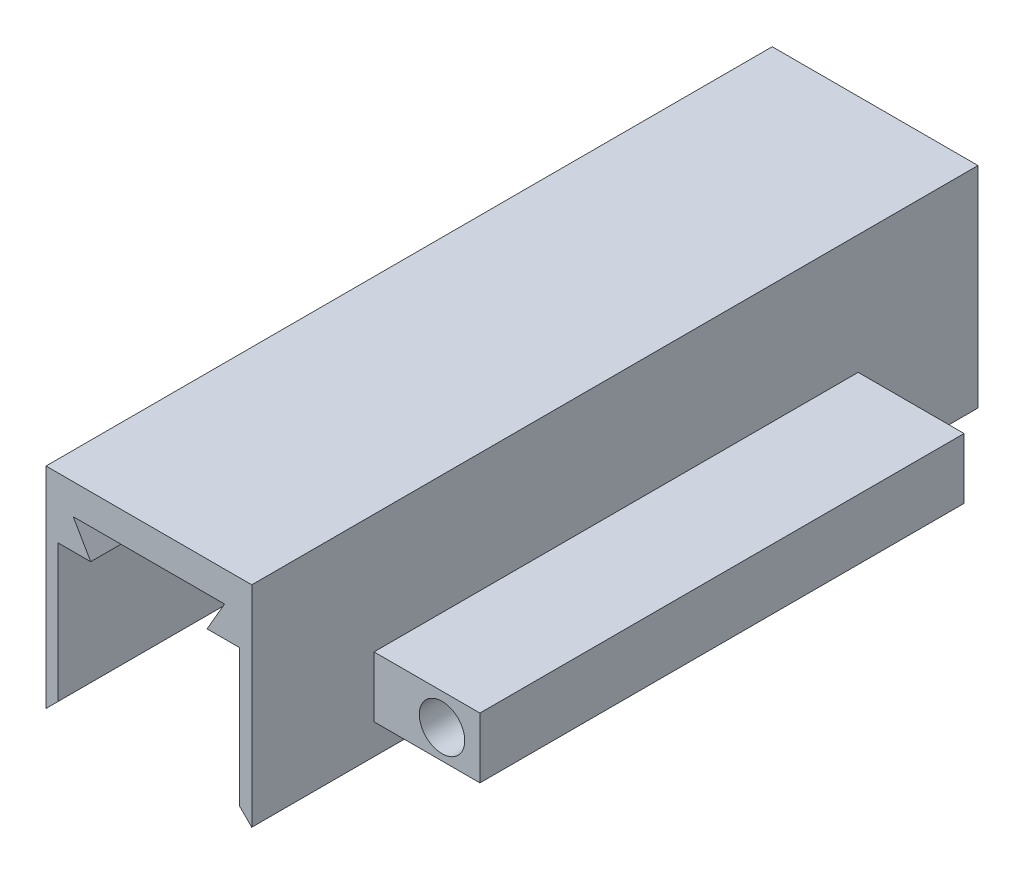
ISO-10303-21;
HEADER;
FILE_DESCRIPTION(('STEP AP214'),'2;1');
FILE_NAME('part.step','',(''),(''),'','','');
FILE_SCHEMA(('AUTOMOTIVE_DESIGN { 1 0 10303 214 1 1 1 1 }'));
ENDSEC;
DATA;
#1=APPLICATION_CONTEXT('core data for automotive mechanical design processes');
#2=APPLICATION_PROTOCOL_DEFINITION('international standard','automotive_design',2000,#1);
#3=PRODUCT_CONTEXT('',#1,'mechanical');
#4=PRODUCT('Part','Part','',(#3));
#5=PRODUCT_RELATED_PRODUCT_CATEGORY('part','',(#4));
#6=PRODUCT_DEFINITION_FORMATION('','',#4);
#7=PRODUCT_DEFINITION_CONTEXT('part definition',#1,'design');
#8=PRODUCT_DEFINITION('design','',#6,#7);
#9=PRODUCT_DEFINITION_SHAPE('','',#8);
#10=(LENGTH_UNIT() NAMED_UNIT(*) SI_UNIT(.MILLI.,.METRE.));
#11=(NAMED_UNIT(*) PLANE_ANGLE_UNIT() SI_UNIT($,.RADIAN.));
#12=(NAMED_UNIT(*) SI_UNIT($,.STERADIAN.) SOLID_ANGLE_UNIT());
#13=UNCERTAINTY_MEASURE_WITH_UNIT(LENGTH_MEASURE(1.E-05),#10,'distance_accuracy_value','');
#14=(GEOMETRIC_REPRESENTATION_CONTEXT(3) GLOBAL_UNCERTAINTY_ASSIGNED_CONTEXT((#13)) GLOBAL_UNIT_ASSIGNED_CONTEXT((#10,
#11,#12)) REPRESENTATION_CONTEXT('',''));
#15=CARTESIAN_POINT('',(0.,0.,0.));
#16=DIRECTION('',(0.,0.,1.));
#17=DIRECTION('',(1.,0.,0.));
#18=AXIS2_PLACEMENT_3D('',#15,#16,#17);
#19=CARTESIAN_POINT('',(2.824,-1.49,-4.));
#20=DIRECTION('',(0.,0.,1.));
#21=DIRECTION('',(1.,0.,0.));
#22=AXIS2_PLACEMENT_3D('',#19,#20,#21);
#23=CYLINDRICAL_SURFACE('',#22,0.375000000000001);
#24=CARTESIAN_POINT('',(2.824,-1.49,4.));
#25=DIRECTION('',(0.,0.,1.));
#26=DIRECTION('',(1.,0.,0.));
#27=AXIS2_PLACEMENT_3D('',#24,#25,#26);
#28=CIRCLE('',#27,0.375000000000001);
#29=CARTESIAN_POINT('',(3.199,-1.49,4.));
#30=VERTEX_POINT('',#29);
#31=EDGE_CURVE('E166',#30,#30,#28,.T.);
#32=ORIENTED_EDGE('',*,*,#31,.T.);
#33=EDGE_LOOP('',(#32));
#34=FACE_BOUND('',#33,.T.);
#35=CARTESIAN_POINT('',(2.824,-1.49,-3.5));
#36=DIRECTION('',(0.,0.,-1.));
#37=DIRECTION('',(-1.,0.,0.));
#38=AXIS2_PLACEMENT_3D('',#35,#36,#37);
#39=CIRCLE('',#38,0.375000000000001);
#40=CARTESIAN_POINT('',(2.449,-1.49,-3.5));
#41=VERTEX_POINT('',#40);
#42=EDGE_CURVE('E11',#41,#41,#39,.F.);
#43=ORIENTED_EDGE('',*,*,#42,.F.);
#44=EDGE_LOOP('',(#43));
#45=FACE_BOUND('',#44,.T.);
#46=ADVANCED_FACE('F35',(#34,#45),#23,.F.);
#47=CARTESIAN_POINT('',(1.7,0.,6.02));
#48=DIRECTION('',(1.,0.,0.));
#49=DIRECTION('',(0.,1.,0.));
#50=AXIS2_PLACEMENT_3D('',#47,#48,#49);
#51=PLANE('',#50);
#52=DIRECTION('',(0.,0.,-1.));
#53=VECTOR('',#52,1.);
#54=CARTESIAN_POINT('',(1.7,-2.47,6.02));
#55=LINE('',#54,#53);
#56=CARTESIAN_POINT('',(1.7,-2.47,6.02));
#57=VERTEX_POINT('',#56);
#58=CARTESIAN_POINT('',(1.7,-2.47,-5.98));
#59=VERTEX_POINT('',#58);
#60=EDGE_CURVE('E267',#57,#59,#55,.T.);
#61=ORIENTED_EDGE('',*,*,#60,.T.);
#62=DIRECTION('',(0.,-1.,0.));
#63=VECTOR('',#62,1.);
#64=CARTESIAN_POINT('',(1.7,0.,-5.98));
#65=LINE('',#64,#63);
#66=CARTESIAN_POINT('',(1.7,1.,-5.98));
#67=VERTEX_POINT('',#66);
#68=EDGE_CURVE('E196',#67,#59,#65,.T.);
#69=ORIENTED_EDGE('',*,*,#68,.F.);
#70=DIRECTION('',(0.,0.,-1.));
#71=VECTOR('',#70,1.);
#72=CARTESIAN_POINT('',(1.7,1.,6.02));
#73=LINE('',#72,#71);
#74=CARTESIAN_POINT('',(1.7,1.,6.02));
#75=VERTEX_POINT('',#74);
#76=EDGE_CURVE('E265',#75,#67,#73,.T.);
#77=ORIENTED_EDGE('',*,*,#76,.F.);
#78=DIRECTION('',(0.,-1.,0.));
#79=VECTOR('',#78,1.);
#80=CARTESIAN_POINT('',(1.7,0.,6.02));
#81=LINE('',#80,#79);
#82=EDGE_CURVE('E228',#75,#57,#81,.T.);
#83=ORIENTED_EDGE('',*,*,#82,.T.);
#84=EDGE_LOOP('',(#61,#69,#77,#83));
#85=FACE_BOUND('',#84,.T.);
#86=DIRECTION('',(0.,0.,1.));
#87=VECTOR('',#86,1.);
#88=CARTESIAN_POINT('',(1.7,-0.969999999999999,-4.));
#89=LINE('',#88,#87);
#90=CARTESIAN_POINT('',(1.7,-0.969999999999999,-4.));
#91=VERTEX_POINT('',#90);
#92=CARTESIAN_POINT('',(1.7,-0.969999999999999,4.));
#93=VERTEX_POINT('',#92);
#94=EDGE_CURVE('E55',#91,#93,#89,.T.);
#95=ORIENTED_EDGE('',*,*,#94,.F.);
#96=DIRECTION('',(0.,-1.,0.));
#97=VECTOR('',#96,1.);
#98=CARTESIAN_POINT('',(1.7,0.,-4.));
#99=LINE('',#98,#97);
#100=CARTESIAN_POINT('',(1.7,-1.97,-4.));
#101=VERTEX_POINT('',#100);
#102=EDGE_CURVE('E50',#91,#101,#99,.T.);
#103=ORIENTED_EDGE('',*,*,#102,.T.);
#104=DIRECTION('',(0.,0.,1.));
#105=VECTOR('',#104,1.);
#106=CARTESIAN_POINT('',(1.7,-1.97,-4.));
#107=LINE('',#106,#105);
#108=CARTESIAN_POINT('',(1.7,-1.97,4.));
#109=VERTEX_POINT('',#108);
#110=EDGE_CURVE('E184',#101,#109,#107,.T.);
#111=ORIENTED_EDGE('',*,*,#110,.T.);
#112=DIRECTION('',(0.,-1.,0.));
#113=VECTOR('',#112,1.);
#114=CARTESIAN_POINT('',(1.7,0.,4.));
#115=LINE('',#114,#113);
#116=EDGE_CURVE('E169',#93,#109,#115,.T.);
#117=ORIENTED_EDGE('',*,*,#116,.F.);
#118=EDGE_LOOP('',(#95,#103,#111,#117));
#119=FACE_BOUND('',#118,.T.);
#120=ADVANCED_FACE('F319',(#85,#119),#51,.T.);
#121=CARTESIAN_POINT('',(0.,0.,6.02));
#122=DIRECTION('',(0.,1.,0.));
#123=DIRECTION('',(0.,0.,1.));
#124=AXIS2_PLACEMENT_3D('',#121,#122,#123);
#125=PLANE('',#124);
#126=DIRECTION('',(0.,0.,-1.));
#127=VECTOR('',#126,1.);
#128=CARTESIAN_POINT('',(0.961324865405187,0.,6.02));
#129=LINE('',#128,#127);
#130=CARTESIAN_POINT('',(0.961324865405187,0.,6.02));
#131=VERTEX_POINT('',#130);
#132=CARTESIAN_POINT('',(0.961324865405187,0.,-5.98));
#133=VERTEX_POINT('',#132);
#134=EDGE_CURVE('E249',#131,#133,#129,.T.);
#135=ORIENTED_EDGE('',*,*,#134,.T.);
#136=DIRECTION('',(1.,0.,0.));
#137=VECTOR('',#136,1.);
#138=CARTESIAN_POINT('',(0.,0.,-5.98));
#139=LINE('',#138,#137);
#140=CARTESIAN_POINT('',(1.5,0.,-5.98));
#141=VERTEX_POINT('',#140);
#142=EDGE_CURVE('E183',#133,#141,#139,.T.);
#143=ORIENTED_EDGE('',*,*,#142,.T.);
#144=DIRECTION('',(0.,0.,-1.));
#145=VECTOR('',#144,1.);
#146=CARTESIAN_POINT('',(1.5,0.,6.02));
#147=LINE('',#146,#145);
#148=CARTESIAN_POINT('',(1.5,0.,6.02));
#149=VERTEX_POINT('',#148);
#150=EDGE_CURVE('E43',#149,#141,#147,.T.);
#151=ORIENTED_EDGE('',*,*,#150,.F.);
#152=DIRECTION('',(1.,0.,0.));
#153=VECTOR('',#152,1.);
#154=CARTESIAN_POINT('',(0.,0.,6.02));
#155=LINE('',#154,#153);
#156=EDGE_CURVE('E220',#131,#149,#155,.T.);
#157=ORIENTED_EDGE('',*,*,#156,.F.);
#158=EDGE_LOOP('',(#135,#143,#151,#157));
#159=FACE_BOUND('',#158,.T.);
#160=ADVANCED_FACE('F280',(#159),#125,.F.);
#161=CARTESIAN_POINT('',(1.5,0.,6.02));
#162=DIRECTION('',(1.,0.,0.));
#163=DIRECTION('',(0.,1.,0.));
#164=AXIS2_PLACEMENT_3D('',#161,#162,#163);
#165=PLANE('',#164);
#166=ORIENTED_EDGE('',*,*,#150,.T.);
#167=DIRECTION('',(0.,-1.,0.));
#168=VECTOR('',#167,1.);
#169=CARTESIAN_POINT('',(1.5,0.,-5.98));
#170=LINE('',#169,#168);
#171=CARTESIAN_POINT('',(1.5,-2.27,-5.98));
#172=VERTEX_POINT('',#171);
#173=EDGE_CURVE('E189',#141,#172,#170,.T.);
#174=ORIENTED_EDGE('',*,*,#173,.T.);
#175=DIRECTION('',(0.,0.,-1.));
#176=VECTOR('',#175,1.);
#177=CARTESIAN_POINT('',(1.5,-2.27,6.02));
#178=LINE('',#177,#176);
#179=CARTESIAN_POINT('',(1.5,-2.27,6.02));
#180=VERTEX_POINT('',#179);
#181=EDGE_CURVE('E269',#180,#172,#178,.T.);
#182=ORIENTED_EDGE('',*,*,#181,.F.);
#183=DIRECTION('',(0.,-1.,0.));
#184=VECTOR('',#183,1.);
#185=CARTESIAN_POINT('',(1.5,0.,6.02));
#186=LINE('',#185,#184);
#187=EDGE_CURVE('E223',#149,#180,#186,.T.);
#188=ORIENTED_EDGE('',*,*,#187,.F.);
#189=EDGE_LOOP('',(#166,#174,#182,#188));
#190=FACE_BOUND('',#189,.T.);
#191=ADVANCED_FACE('F37',(#190),#165,.F.);
#192=CARTESIAN_POINT('',(-0.384999999999999,-0.384999999999998,6.02));
#193=DIRECTION('',(0.707106781186548,0.707106781186547,0.));
#194=DIRECTION('',(-0.707106781186547,0.707106781186548,0.));
#195=AXIS2_PLACEMENT_3D('',#192,#193,#194);
#196=PLANE('',#195);
#197=ORIENTED_EDGE('',*,*,#181,.T.);
#198=DIRECTION('',(0.707106781186547,-0.707106781186548,0.));
#199=VECTOR('',#198,1.);
#200=CARTESIAN_POINT('',(-0.384999999999999,-0.384999999999998,-5.98));
#201=LINE('',#200,#199);
#202=EDGE_CURVE('E193',#172,#59,#201,.T.);
#203=ORIENTED_EDGE('',*,*,#202,.T.);
#204=ORIENTED_EDGE('',*,*,#60,.F.);
#205=DIRECTION('',(0.707106781186547,-0.707106781186548,0.));
#206=VECTOR('',#205,1.);
#207=CARTESIAN_POINT('',(-0.384999999999999,-0.384999999999998,6.02));
#208=LINE('',#207,#206);
#209=EDGE_CURVE('E226',#180,#57,#208,.T.);
#210=ORIENTED_EDGE('',*,*,#209,.F.);
#211=EDGE_LOOP('',(#197,#203,#204,#210));
#212=FACE_BOUND('',#211,.T.);
#213=ADVANCED_FACE('F324',(#212),#196,.F.);
#214=CARTESIAN_POINT('',(0.,1.,6.02));
#215=DIRECTION('',(0.,1.,0.));
#216=DIRECTION('',(0.,0.,1.));
#217=AXIS2_PLACEMENT_3D('',#214,#215,#216);
#218=PLANE('',#217);
#219=ORIENTED_EDGE('',*,*,#76,.T.);
#220=DIRECTION('',(1.,0.,0.));
#221=VECTOR('',#220,1.);
#222=CARTESIAN_POINT('',(0.,1.,-5.98));
#223=LINE('',#222,#221);
#224=CARTESIAN_POINT('',(-1.7,1.,-5.98));
#225=VERTEX_POINT('',#224);
#226=EDGE_CURVE('E199',#225,#67,#223,.T.);
#227=ORIENTED_EDGE('',*,*,#226,.F.);
#228=DIRECTION('',(0.,0.,-1.));
#229=VECTOR('',#228,1.);
#230=CARTESIAN_POINT('',(-1.7,1.,6.02));
#231=LINE('',#230,#229);
#232=CARTESIAN_POINT('',(-1.7,1.,6.02));
#233=VERTEX_POINT('',#232);
#234=EDGE_CURVE('E263',#233,#225,#231,.T.);
#235=ORIENTED_EDGE('',*,*,#234,.F.);
#236=DIRECTION('',(1.,0.,0.));
#237=VECTOR('',#236,1.);
#238=CARTESIAN_POINT('',(0.,1.,6.02));
#239=LINE('',#238,#237);
#240=EDGE_CURVE('E231',#233,#75,#239,.T.);
#241=ORIENTED_EDGE('',*,*,#240,.T.);
#242=EDGE_LOOP('',(#219,#227,#235,#241));
#243=FACE_BOUND('',#242,.T.);
#244=ADVANCED_FACE('F327',(#243),#218,.T.);
#245=CARTESIAN_POINT('',(-1.7,0.,6.02));
#246=DIRECTION('',(1.,0.,0.));
#247=DIRECTION('',(0.,1.,0.));
#248=AXIS2_PLACEMENT_3D('',#245,#246,#247);
#249=PLANE('',#248);
#250=ORIENTED_EDGE('',*,*,#234,.T.);
#251=DIRECTION('',(0.,-1.,0.));
#252=VECTOR('',#251,1.);
#253=CARTESIAN_POINT('',(-1.7,0.,-5.98));
#254=LINE('',#253,#252);
#255=CARTESIAN_POINT('',(-1.7,-2.47,-5.98));
#256=VERTEX_POINT('',#255);
#257=EDGE_CURVE('E202',#225,#256,#254,.T.);
#258=ORIENTED_EDGE('',*,*,#257,.T.);
#259=DIRECTION('',(0.,0.,-1.));
#260=VECTOR('',#259,1.);
#261=CARTESIAN_POINT('',(-1.7,-2.47,6.02));
#262=LINE('',#261,#260);
#263=CARTESIAN_POINT('',(-1.7,-2.47,6.02));
#264=VERTEX_POINT('',#263);
#265=EDGE_CURVE('E261',#264,#256,#262,.T.);
#266=ORIENTED_EDGE('',*,*,#265,.F.);
#267=DIRECTION('',(0.,-1.,0.));
#268=VECTOR('',#267,1.);
#269=CARTESIAN_POINT('',(-1.7,0.,6.02));
#270=LINE('',#269,#268);
#271=EDGE_CURVE('E234',#233,#264,#270,.T.);
#272=ORIENTED_EDGE('',*,*,#271,.F.);
#273=EDGE_LOOP('',(#250,#258,#266,#272));
#274=FACE_BOUND('',#273,.T.);
#275=ADVANCED_FACE('F313',(#274),#249,.F.);
#276=CARTESIAN_POINT('',(0.384999999999999,-0.384999999999998,6.02));
#277=DIRECTION('',(-0.707106781186548,0.707106781186547,0.));
#278=DIRECTION('',(-0.707106781186547,-0.707106781186548,0.));
#279=AXIS2_PLACEMENT_3D('',#276,#277,#278);
#280=PLANE('',#279);
#281=ORIENTED_EDGE('',*,*,#265,.T.);
#282=DIRECTION('',(0.707106781186547,0.707106781186548,0.));
#283=VECTOR('',#282,1.);
#284=CARTESIAN_POINT('',(0.384999999999999,-0.384999999999998,-5.98));
#285=LINE('',#284,#283);
#286=CARTESIAN_POINT('',(-1.5,-2.27,-5.98));
#287=VERTEX_POINT('',#286);
#288=EDGE_CURVE('E205',#256,#287,#285,.T.);
#289=ORIENTED_EDGE('',*,*,#288,.T.);
#290=DIRECTION('',(0.,0.,-1.));
#291=VECTOR('',#290,1.);
#292=CARTESIAN_POINT('',(-1.5,-2.27,6.02));
#293=LINE('',#292,#291);
#294=CARTESIAN_POINT('',(-1.5,-2.27,6.02));
#295=VERTEX_POINT('',#294);
#296=EDGE_CURVE('E259',#295,#287,#293,.T.);
#297=ORIENTED_EDGE('',*,*,#296,.F.);
#298=DIRECTION('',(0.707106781186547,0.707106781186548,0.));
#299=VECTOR('',#298,1.);
#300=CARTESIAN_POINT('',(0.384999999999999,-0.384999999999998,6.02));
#301=LINE('',#300,#299);
#302=EDGE_CURVE('E236',#264,#295,#301,.T.);
#303=ORIENTED_EDGE('',*,*,#302,.F.);
#304=EDGE_LOOP('',(#281,#289,#297,#303));
#305=FACE_BOUND('',#304,.T.);
#306=ADVANCED_FACE('F308',(#305),#280,.F.);
#307=CARTESIAN_POINT('',(-1.5,0.,6.02));
#308=DIRECTION('',(1.,0.,0.));
#309=DIRECTION('',(0.,0.,-1.));
#310=AXIS2_PLACEMENT_3D('',#307,#308,#309);
#311=PLANE('',#310);
#312=ORIENTED_EDGE('',*,*,#296,.T.);
#313=DIRECTION('',(0.,-1.,0.));
#314=VECTOR('',#313,1.);
#315=CARTESIAN_POINT('',(-1.5,0.,-5.98));
#316=LINE('',#315,#314);
#317=CARTESIAN_POINT('',(-1.5,0.,-5.98));
#318=VERTEX_POINT('',#317);
#319=EDGE_CURVE('E208',#318,#287,#316,.T.);
#320=ORIENTED_EDGE('',*,*,#319,.F.);
#321=DIRECTION('',(0.,0.,-1.));
#322=VECTOR('',#321,1.);
#323=CARTESIAN_POINT('',(-1.5,0.,6.02));
#324=LINE('',#323,#322);
#325=CARTESIAN_POINT('',(-1.5,0.,6.02));
#326=VERTEX_POINT('',#325);
#327=EDGE_CURVE('E257',#326,#318,#324,.T.);
#328=ORIENTED_EDGE('',*,*,#327,.F.);
#329=DIRECTION('',(0.,-1.,0.));
#330=VECTOR('',#329,1.);
#331=CARTESIAN_POINT('',(-1.5,0.,6.02));
#332=LINE('',#331,#330);
#333=EDGE_CURVE('E238',#326,#295,#332,.T.);
#334=ORIENTED_EDGE('',*,*,#333,.T.);
#335=EDGE_LOOP('',(#312,#320,#328,#334));
#336=FACE_BOUND('',#335,.T.);
#337=ADVANCED_FACE('F303',(#336),#311,.T.);
#338=ORIENTED_EDGE('',*,*,#327,.T.);
#339=CARTESIAN_POINT('',(-0.961324865405186,0.,-5.98));
#340=VERTEX_POINT('',#339);
#341=EDGE_CURVE('E190',#318,#340,#139,.T.);
#342=ORIENTED_EDGE('',*,*,#341,.T.);
#343=DIRECTION('',(0.,0.,-1.));
#344=VECTOR('',#343,1.);
#345=CARTESIAN_POINT('',(-0.961324865405186,0.,6.02));
#346=LINE('',#345,#344);
#347=CARTESIAN_POINT('',(-0.961324865405186,0.,6.02));
#348=VERTEX_POINT('',#347);
#349=EDGE_CURVE('E255',#348,#340,#346,.T.);
#350=ORIENTED_EDGE('',*,*,#349,.F.);
#351=EDGE_CURVE('E224',#326,#348,#155,.T.);
#352=ORIENTED_EDGE('',*,*,#351,.F.);
#353=EDGE_LOOP('',(#338,#342,#350,#352));
#354=FACE_BOUND('',#353,.T.);
#355=ADVANCED_FACE('F298',(#354),#125,.F.);
#356=CARTESIAN_POINT('',(-0.72099364905389,-0.416265877365273,6.02));
#357=DIRECTION('',(0.866025403784439,0.5,0.));
#358=DIRECTION('',(-0.5,0.866025403784439,0.));
#359=AXIS2_PLACEMENT_3D('',#356,#357,#358);
#360=PLANE('',#359);
#361=ORIENTED_EDGE('',*,*,#349,.T.);
#362=DIRECTION('',(0.5,-0.866025403784439,0.));
#363=VECTOR('',#362,1.);
#364=CARTESIAN_POINT('',(-0.72099364905389,-0.416265877365273,-5.98));
#365=LINE('',#364,#363);
#366=CARTESIAN_POINT('',(-1.25,0.500000000000001,-5.98));
#367=VERTEX_POINT('',#366);
#368=EDGE_CURVE('E211',#367,#340,#365,.T.);
#369=ORIENTED_EDGE('',*,*,#368,.F.);
#370=DIRECTION('',(0.,0.,-1.));
#371=VECTOR('',#370,1.);
#372=CARTESIAN_POINT('',(-1.25,0.500000000000001,6.02));
#373=LINE('',#372,#371);
#374=CARTESIAN_POINT('',(-1.25,0.500000000000001,6.02));
#375=VERTEX_POINT('',#374);
#376=EDGE_CURVE('E253',#375,#367,#373,.T.);
#377=ORIENTED_EDGE('',*,*,#376,.F.);
#378=DIRECTION('',(0.5,-0.866025403784439,0.));
#379=VECTOR('',#378,1.);
#380=CARTESIAN_POINT('',(-0.72099364905389,-0.416265877365273,6.02));
#381=LINE('',#380,#379);
#382=EDGE_CURVE('E241',#375,#348,#381,.T.);
#383=ORIENTED_EDGE('',*,*,#382,.T.);
#384=EDGE_LOOP('',(#361,#369,#377,#383));
#385=FACE_BOUND('',#384,.T.);
#386=ADVANCED_FACE('F293',(#385),#360,.T.);
#387=CARTESIAN_POINT('',(0.,0.500000000000001,6.02));
#388=DIRECTION('',(0.,1.,0.));
#389=DIRECTION('',(-1.,0.,0.));
#390=AXIS2_PLACEMENT_3D('',#387,#388,#389);
#391=PLANE('',#390);
#392=ORIENTED_EDGE('',*,*,#376,.T.);
#393=DIRECTION('',(1.,0.,0.));
#394=VECTOR('',#393,1.);
#395=CARTESIAN_POINT('',(0.,0.500000000000001,-5.98));
#396=LINE('',#395,#394);
#397=CARTESIAN_POINT('',(1.25,0.5,-5.98));
#398=VERTEX_POINT('',#397);
#399=EDGE_CURVE('E214',#367,#398,#396,.T.);
#400=ORIENTED_EDGE('',*,*,#399,.T.);
#401=DIRECTION('',(0.,0.,-1.));
#402=VECTOR('',#401,1.);
#403=CARTESIAN_POINT('',(1.25,0.5,6.02));
#404=LINE('',#403,#402);
#405=CARTESIAN_POINT('',(1.25,0.5,6.02));
#406=VERTEX_POINT('',#405);
#407=EDGE_CURVE('E251',#406,#398,#404,.T.);
#408=ORIENTED_EDGE('',*,*,#407,.F.);
#409=DIRECTION('',(1.,0.,0.));
#410=VECTOR('',#409,1.);
#411=CARTESIAN_POINT('',(0.,0.500000000000001,6.02));
#412=LINE('',#411,#410);
#413=EDGE_CURVE('E244',#375,#406,#412,.T.);
#414=ORIENTED_EDGE('',*,*,#413,.F.);
#415=EDGE_LOOP('',(#392,#400,#408,#414));
#416=FACE_BOUND('',#415,.T.);
#417=ADVANCED_FACE('F288',(#416),#391,.F.);
#418=CARTESIAN_POINT('',(0.72099364905389,-0.416265877365274,6.02));
#419=DIRECTION('',(-0.866025403784439,0.5,0.));
#420=DIRECTION('',(-0.5,-0.866025403784439,0.));
#421=AXIS2_PLACEMENT_3D('',#418,#419,#420);
#422=PLANE('',#421);
#423=ORIENTED_EDGE('',*,*,#407,.T.);
#424=DIRECTION('',(0.5,0.866025403784439,0.));
#425=VECTOR('',#424,1.);
#426=CARTESIAN_POINT('',(0.72099364905389,-0.416265877365274,-5.98));
#427=LINE('',#426,#425);
#428=EDGE_CURVE('E217',#133,#398,#427,.T.);
#429=ORIENTED_EDGE('',*,*,#428,.F.);
#430=ORIENTED_EDGE('',*,*,#134,.F.);
#431=DIRECTION('',(0.5,0.866025403784439,0.));
#432=VECTOR('',#431,1.);
#433=CARTESIAN_POINT('',(0.72099364905389,-0.416265877365274,6.02));
#434=LINE('',#433,#432);
#435=EDGE_CURVE('E246',#131,#406,#434,.T.);
#436=ORIENTED_EDGE('',*,*,#435,.T.);
#437=EDGE_LOOP('',(#423,#429,#430,#436));
#438=FACE_BOUND('',#437,.T.);
#439=ADVANCED_FACE('F284',(#438),#422,.T.);
#440=CARTESIAN_POINT('',(0.,0.,6.02));
#441=DIRECTION('',(0.,0.,1.));
#442=DIRECTION('',(1.,0.,0.));
#443=AXIS2_PLACEMENT_3D('',#440,#441,#442);
#444=PLANE('',#443);
#445=ORIENTED_EDGE('',*,*,#156,.T.);
#446=ORIENTED_EDGE('',*,*,#187,.T.);
#447=ORIENTED_EDGE('',*,*,#209,.T.);
#448=ORIENTED_EDGE('',*,*,#82,.F.);
#449=ORIENTED_EDGE('',*,*,#240,.F.);
#450=ORIENTED_EDGE('',*,*,#271,.T.);
#451=ORIENTED_EDGE('',*,*,#302,.T.);
#452=ORIENTED_EDGE('',*,*,#333,.F.);
#453=ORIENTED_EDGE('',*,*,#351,.T.);
#454=ORIENTED_EDGE('',*,*,#382,.F.);
#455=ORIENTED_EDGE('',*,*,#413,.T.);
#456=ORIENTED_EDGE('',*,*,#435,.F.);
#457=EDGE_LOOP('',(#445,#446,#447,#448,#449,#450,#451,#452,#453,#454,#455,#456));
#458=FACE_BOUND('',#457,.T.);
#459=ADVANCED_FACE('F326',(#458),#444,.T.);
#460=CARTESIAN_POINT('',(0.,0.,-5.98));
#461=DIRECTION('',(0.,0.,1.));
#462=DIRECTION('',(1.,0.,0.));
#463=AXIS2_PLACEMENT_3D('',#460,#461,#462);
#464=PLANE('',#463);
#465=ORIENTED_EDGE('',*,*,#142,.F.);
#466=ORIENTED_EDGE('',*,*,#428,.T.);
#467=ORIENTED_EDGE('',*,*,#399,.F.);
#468=ORIENTED_EDGE('',*,*,#368,.T.);
#469=ORIENTED_EDGE('',*,*,#341,.F.);
#470=ORIENTED_EDGE('',*,*,#319,.T.);
#471=ORIENTED_EDGE('',*,*,#288,.F.);
#472=ORIENTED_EDGE('',*,*,#257,.F.);
#473=ORIENTED_EDGE('',*,*,#226,.T.);
#474=ORIENTED_EDGE('',*,*,#68,.T.);
#475=ORIENTED_EDGE('',*,*,#202,.F.);
#476=ORIENTED_EDGE('',*,*,#173,.F.);
#477=EDGE_LOOP('',(#465,#466,#467,#468,#469,#470,#471,#472,#473,#474,#475,#476));
#478=FACE_BOUND('',#477,.T.);
#479=ADVANCED_FACE('F279',(#478),#464,.F.);
#480=CARTESIAN_POINT('',(3.45,0.,-4.));
#481=DIRECTION('',(-1.,0.,0.));
#482=DIRECTION('',(0.,-1.,0.));
#483=AXIS2_PLACEMENT_3D('',#480,#481,#482);
#484=PLANE('',#483);
#485=DIRECTION('',(0.,0.,1.));
#486=VECTOR('',#485,1.);
#487=CARTESIAN_POINT('',(3.45,-0.969999999999999,-4.));
#488=LINE('',#487,#486);
#489=CARTESIAN_POINT('',(3.45,-0.969999999999999,-4.));
#490=VERTEX_POINT('',#489);
#491=CARTESIAN_POINT('',(3.45,-0.969999999999999,4.));
#492=VERTEX_POINT('',#491);
#493=EDGE_CURVE('E148',#490,#492,#488,.T.);
#494=ORIENTED_EDGE('',*,*,#493,.T.);
#495=DIRECTION('',(0.,-1.,0.));
#496=VECTOR('',#495,1.);
#497=CARTESIAN_POINT('',(3.45,0.,4.));
#498=LINE('',#497,#496);
#499=CARTESIAN_POINT('',(3.45,-1.97,4.));
#500=VERTEX_POINT('',#499);
#501=EDGE_CURVE('E152',#492,#500,#498,.T.);
#502=ORIENTED_EDGE('',*,*,#501,.T.);
#503=DIRECTION('',(0.,0.,1.));
#504=VECTOR('',#503,1.);
#505=CARTESIAN_POINT('',(3.45,-1.97,-4.));
#506=LINE('',#505,#504);
#507=CARTESIAN_POINT('',(3.45,-1.97,-4.));
#508=VERTEX_POINT('',#507);
#509=EDGE_CURVE('E181',#508,#500,#506,.T.);
#510=ORIENTED_EDGE('',*,*,#509,.F.);
#511=DIRECTION('',(0.,-1.,0.));
#512=VECTOR('',#511,1.);
#513=CARTESIAN_POINT('',(3.45,0.,-4.));
#514=LINE('',#513,#512);
#515=EDGE_CURVE('E153',#490,#508,#514,.T.);
#516=ORIENTED_EDGE('',*,*,#515,.F.);
#517=EDGE_LOOP('',(#494,#502,#510,#516));
#518=FACE_BOUND('',#517,.T.);
#519=ADVANCED_FACE('F150',(#518),#484,.F.);
#520=CARTESIAN_POINT('',(0.,-1.97,-4.));
#521=DIRECTION('',(0.,-1.,0.));
#522=DIRECTION('',(0.,0.,-1.));
#523=AXIS2_PLACEMENT_3D('',#520,#521,#522);
#524=PLANE('',#523);
#525=ORIENTED_EDGE('',*,*,#509,.T.);
#526=DIRECTION('',(1.,0.,0.));
#527=VECTOR('',#526,1.);
#528=CARTESIAN_POINT('',(0.,-1.97,4.));
#529=LINE('',#528,#527);
#530=EDGE_CURVE('E165',#109,#500,#529,.T.);
#531=ORIENTED_EDGE('',*,*,#530,.F.);
#532=ORIENTED_EDGE('',*,*,#110,.F.);
#533=DIRECTION('',(1.,0.,0.));
#534=VECTOR('',#533,1.);
#535=CARTESIAN_POINT('',(0.,-1.97,-4.));
#536=LINE('',#535,#534);
#537=EDGE_CURVE('E156',#101,#508,#536,.T.);
#538=ORIENTED_EDGE('',*,*,#537,.T.);
#539=EDGE_LOOP('',(#525,#531,#532,#538));
#540=FACE_BOUND('',#539,.T.);
#541=ADVANCED_FACE('F401',(#540),#524,.T.);
#542=CARTESIAN_POINT('',(0.,-0.969999999999999,-4.));
#543=DIRECTION('',(0.,-1.,0.));
#544=DIRECTION('',(0.,0.,-1.));
#545=AXIS2_PLACEMENT_3D('',#542,#543,#544);
#546=PLANE('',#545);
#547=ORIENTED_EDGE('',*,*,#94,.T.);
#548=DIRECTION('',(1.,0.,0.));
#549=VECTOR('',#548,1.);
#550=CARTESIAN_POINT('',(0.,-0.969999999999999,4.));
#551=LINE('',#550,#549);
#552=EDGE_CURVE('E163',#93,#492,#551,.T.);
#553=ORIENTED_EDGE('',*,*,#552,.T.);
#554=ORIENTED_EDGE('',*,*,#493,.F.);
#555=DIRECTION('',(1.,0.,0.));
#556=VECTOR('',#555,1.);
#557=CARTESIAN_POINT('',(0.,-0.969999999999999,-4.));
#558=LINE('',#557,#556);
#559=EDGE_CURVE('E176',#91,#490,#558,.T.);
#560=ORIENTED_EDGE('',*,*,#559,.F.);
#561=EDGE_LOOP('',(#547,#553,#554,#560));
#562=FACE_BOUND('',#561,.T.);
#563=ADVANCED_FACE('F168',(#562),#546,.F.);
#564=CARTESIAN_POINT('',(0.,0.,-4.));
#565=DIRECTION('',(0.,0.,1.));
#566=DIRECTION('',(1.,0.,0.));
#567=AXIS2_PLACEMENT_3D('',#564,#565,#566);
#568=PLANE('',#567);
#569=ORIENTED_EDGE('',*,*,#515,.T.);
#570=ORIENTED_EDGE('',*,*,#537,.F.);
#571=ORIENTED_EDGE('',*,*,#102,.F.);
#572=ORIENTED_EDGE('',*,*,#559,.T.);
#573=EDGE_LOOP('',(#569,#570,#571,#572));
#574=FACE_BOUND('',#573,.T.);
#575=ADVANCED_FACE('F414',(#574),#568,.F.);
#576=CARTESIAN_POINT('',(0.,0.,4.));
#577=DIRECTION('',(0.,0.,1.));
#578=DIRECTION('',(1.,0.,0.));
#579=AXIS2_PLACEMENT_3D('',#576,#577,#578);
#580=PLANE('',#579);
#581=ORIENTED_EDGE('',*,*,#31,.F.);
#582=EDGE_LOOP('',(#581));
#583=FACE_BOUND('',#582,.T.);
#584=ORIENTED_EDGE('',*,*,#501,.F.);
#585=ORIENTED_EDGE('',*,*,#552,.F.);
#586=ORIENTED_EDGE('',*,*,#116,.T.);
#587=ORIENTED_EDGE('',*,*,#530,.T.);
#588=EDGE_LOOP('',(#584,#585,#586,#587));
#589=FACE_BOUND('',#588,.T.);
#590=ADVANCED_FACE('F161',(#583,#589),#580,.T.);
#591=CARTESIAN_POINT('',(2.824,-1.49,-3.5));
#592=DIRECTION('',(0.,0.,-1.));
#593=DIRECTION('',(-1.,0.,0.));
#594=AXIS2_PLACEMENT_3D('',#591,#592,#593);
#595=PLANE('',#594);
#596=ORIENTED_EDGE('',*,*,#42,.T.);
#597=EDGE_LOOP('',(#596));
#598=FACE_BOUND('',#597,.T.);
#599=ADVANCED_FACE('F428',(#598),#595,.F.);
#600=CLOSED_SHELL('',(#46,#120,#160,#191,#213,#244,#275,#306,#337,#355,#386,#417,#439,#459,#479,
#519,#541,#563,#575,#590,#599));
#601=MANIFOLD_SOLID_BREP('B2',#600);
#602=ADVANCED_BREP_SHAPE_REPRESENTATION('',(#18,#601),#14);
#603=SHAPE_DEFINITION_REPRESENTATION(#9,#602);
ENDSEC;
END-ISO-10303-21;
